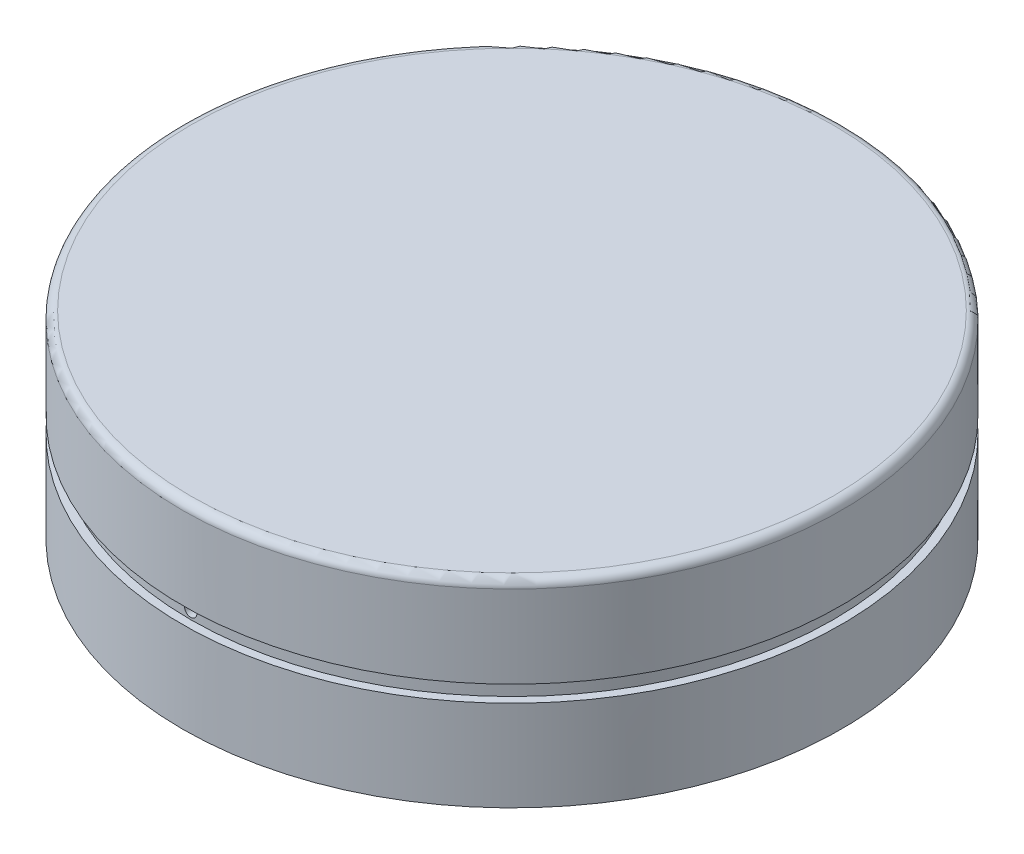
ISO-10303-21;
HEADER;
FILE_DESCRIPTION(('STEP AP214'),'2;1');
FILE_NAME('part.step','',(''),(''),'','','');
FILE_SCHEMA(('AUTOMOTIVE_DESIGN { 1 0 10303 214 1 1 1 1 }'));
ENDSEC;
DATA;
#1=APPLICATION_CONTEXT('core data for automotive mechanical design processes');
#2=APPLICATION_PROTOCOL_DEFINITION('international standard','automotive_design',2000,#1);
#3=PRODUCT_CONTEXT('',#1,'mechanical');
#4=PRODUCT('Part','Part','',(#3));
#5=PRODUCT_RELATED_PRODUCT_CATEGORY('part','',(#4));
#6=PRODUCT_DEFINITION_FORMATION('','',#4);
#7=PRODUCT_DEFINITION_CONTEXT('part definition',#1,'design');
#8=PRODUCT_DEFINITION('design','',#6,#7);
#9=PRODUCT_DEFINITION_SHAPE('','',#8);
#10=(LENGTH_UNIT() NAMED_UNIT(*) SI_UNIT(.MILLI.,.METRE.));
#11=(NAMED_UNIT(*) PLANE_ANGLE_UNIT() SI_UNIT($,.RADIAN.));
#12=(NAMED_UNIT(*) SI_UNIT($,.STERADIAN.) SOLID_ANGLE_UNIT());
#13=UNCERTAINTY_MEASURE_WITH_UNIT(LENGTH_MEASURE(1.E-05),#10,'distance_accuracy_value','');
#14=(GEOMETRIC_REPRESENTATION_CONTEXT(3) GLOBAL_UNCERTAINTY_ASSIGNED_CONTEXT((#13)) GLOBAL_UNIT_ASSIGNED_CONTEXT((#10,
#11,#12)) REPRESENTATION_CONTEXT('',''));
#15=CARTESIAN_POINT('',(0.,0.,0.));
#16=DIRECTION('',(0.,0.,1.));
#17=DIRECTION('',(1.,0.,0.));
#18=AXIS2_PLACEMENT_3D('',#15,#16,#17);
#19=CARTESIAN_POINT('',(0.,6.,0.));
#20=DIRECTION('',(0.,-1.,0.));
#21=DIRECTION('',(0.,0.,-1.));
#22=AXIS2_PLACEMENT_3D('',#19,#20,#21);
#23=CYLINDRICAL_SURFACE('',#22,20.);
#24=CARTESIAN_POINT('',(0.,-0.5,0.));
#25=DIRECTION('',(0.,-1.,0.));
#26=DIRECTION('',(0.,0.,-1.));
#27=AXIS2_PLACEMENT_3D('',#24,#25,#26);
#28=CIRCLE('',#27,20.);
#29=CARTESIAN_POINT('',(0.,-0.5,-20.));
#30=VERTEX_POINT('',#29);
#31=EDGE_CURVE('E162',#30,#30,#28,.T.);
#32=ORIENTED_EDGE('',*,*,#31,.T.);
#33=EDGE_LOOP('',(#32));
#34=FACE_BOUND('',#33,.T.);
#35=CARTESIAN_POINT('',(0.,-6.,0.));
#36=DIRECTION('',(0.,1.,0.));
#37=DIRECTION('',(0.,0.,1.));
#38=AXIS2_PLACEMENT_3D('',#35,#36,#37);
#39=CIRCLE('',#38,20.);
#40=CARTESIAN_POINT('',(0.,-6.,20.));
#41=VERTEX_POINT('',#40);
#42=EDGE_CURVE('E145',#41,#41,#39,.T.);
#43=ORIENTED_EDGE('',*,*,#42,.T.);
#44=EDGE_LOOP('',(#43));
#45=FACE_BOUND('',#44,.T.);
#46=ADVANCED_FACE('F39',(#34,#45),#23,.T.);
#47=CARTESIAN_POINT('',(0.,-6.,0.));
#48=DIRECTION('',(0.,1.,0.));
#49=DIRECTION('',(0.,0.,1.));
#50=AXIS2_PLACEMENT_3D('',#47,#48,#49);
#51=PLANE('',#50);
#52=CARTESIAN_POINT('',(0.,-6.,0.));
#53=DIRECTION('',(0.,-1.,0.));
#54=DIRECTION('',(0.,0.,-1.));
#55=AXIS2_PLACEMENT_3D('',#52,#53,#54);
#56=CIRCLE('',#55,19.);
#57=CARTESIAN_POINT('',(0.,-6.,-19.));
#58=VERTEX_POINT('',#57);
#59=EDGE_CURVE('E153',#58,#58,#56,.T.);
#60=ORIENTED_EDGE('',*,*,#59,.F.);
#61=EDGE_LOOP('',(#60));
#62=FACE_BOUND('',#61,.T.);
#63=ORIENTED_EDGE('',*,*,#42,.F.);
#64=EDGE_LOOP('',(#63));
#65=FACE_BOUND('',#64,.T.);
#66=ADVANCED_FACE('F111',(#62,#65),#51,.F.);
#67=CARTESIAN_POINT('',(0.,5.,0.));
#68=DIRECTION('',(0.,1.,0.));
#69=DIRECTION('',(0.,0.,1.));
#70=AXIS2_PLACEMENT_3D('',#67,#68,#69);
#71=PLANE('',#70);
#72=CARTESIAN_POINT('',(0.,5.,0.));
#73=DIRECTION('',(0.,1.,0.));
#74=DIRECTION('',(0.,0.,1.));
#75=AXIS2_PLACEMENT_3D('',#72,#73,#74);
#76=CIRCLE('',#75,7.9);
#77=CARTESIAN_POINT('',(0.,5.,7.9));
#78=VERTEX_POINT('',#77);
#79=EDGE_CURVE('E46',#78,#78,#76,.F.);
#80=ORIENTED_EDGE('',*,*,#79,.F.);
#81=EDGE_LOOP('',(#80));
#82=FACE_BOUND('',#81,.T.);
#83=CARTESIAN_POINT('',(0.,5.,0.));
#84=DIRECTION('',(0.,1.,0.));
#85=DIRECTION('',(0.,0.,1.));
#86=AXIS2_PLACEMENT_3D('',#83,#84,#85);
#87=CIRCLE('',#86,19.);
#88=CARTESIAN_POINT('',(0.,5.,19.));
#89=VERTEX_POINT('',#88);
#90=EDGE_CURVE('E148',#89,#89,#87,.F.);
#91=ORIENTED_EDGE('',*,*,#90,.T.);
#92=EDGE_LOOP('',(#91));
#93=FACE_BOUND('',#92,.T.);
#94=ADVANCED_FACE('F106',(#82,#93),#71,.F.);
#95=CARTESIAN_POINT('',(0.,59.7401153701776,0.));
#96=DIRECTION('',(0.,-1.,0.));
#97=DIRECTION('',(0.,0.,-1.));
#98=AXIS2_PLACEMENT_3D('',#95,#96,#97);
#99=CYLINDRICAL_SURFACE('',#98,19.);
#100=CARTESIAN_POINT('',(0.,0.375,-19.));
#101=CARTESIAN_POINT('',(0.0210617140066825,0.374999066680883,-18.9999999500342));
#102=CARTESIAN_POINT('',(0.0421386475309483,0.373219662071169,-18.9999646033929));
#103=CARTESIAN_POINT('',(0.0837118939057291,0.366146041087272,-18.9998269966186));
#104=CARTESIAN_POINT('',(0.104207479392599,0.360847608010525,-18.9997246562118));
#105=CARTESIAN_POINT('',(0.144009731300136,0.346886958485237,-18.9994646537768));
#106=CARTESIAN_POINT('',(0.163316966343931,0.338226365549888,-18.9993070184528));
#107=CARTESIAN_POINT('',(0.200198052213595,0.31778951175328,-18.9989542158596));
#108=CARTESIAN_POINT('',(0.21777232918228,0.306014019496927,-18.9987590578525));
#109=CARTESIAN_POINT('',(0.250698992429135,0.279677555343755,-18.9983531300634));
#110=CARTESIAN_POINT('',(0.266050875050938,0.265115953767636,-18.9981423567589));
#111=CARTESIAN_POINT('',(0.294092797867601,0.233621517945313,-18.9977289856158));
#112=CARTESIAN_POINT('',(0.30678273289282,0.216688590055548,-18.9975263881005));
#113=CARTESIAN_POINT('',(0.329140584649192,0.180931246230006,-18.9971522068589));
#114=CARTESIAN_POINT('',(0.338808310986764,0.162106711225145,-18.9969806250868));
#115=CARTESIAN_POINT('',(0.354846027995322,0.12310138475274,-18.9966878429425));
#116=CARTESIAN_POINT('',(0.361216028149724,0.102920597185621,-18.9965666424254));
#117=CARTESIAN_POINT('',(0.370476696064507,0.0617783929131159,-18.9963883065815));
#118=CARTESIAN_POINT('',(0.373367816596021,0.0408170781583803,-18.9963311629178));
#119=CARTESIAN_POINT('',(0.375590047560634,-0.00129344323055079,-18.9962873585584));
#120=CARTESIAN_POINT('',(0.374921167782152,-0.0224426493479687,-18.996300697669));
#121=CARTESIAN_POINT('',(0.370042779908349,-0.0643255282850536,-18.996396346851));
#122=CARTESIAN_POINT('',(0.365833764324944,-0.08505925849591,-18.9964786473284));
#123=CARTESIAN_POINT('',(0.353995343150468,-0.125525774284567,-18.9967029259046));
#124=CARTESIAN_POINT('',(0.346365932250407,-0.14525855830869,-18.9968449040959));
#125=CARTESIAN_POINT('',(0.327902728748842,-0.183164602866868,-18.997172543033));
#126=CARTESIAN_POINT('',(0.317068710245521,-0.201337753341405,-18.9973582068582));
#127=CARTESIAN_POINT('',(0.292504005244711,-0.235607442913076,-18.9977522825847));
#128=CARTESIAN_POINT('',(0.278773316546485,-0.251703980432494,-18.9979606945032));
#129=CARTESIAN_POINT('',(0.248802245780262,-0.281366395829723,-18.9983768135495));
#130=CARTESIAN_POINT('',(0.232561435692743,-0.294931841239763,-18.9985845205509));
#131=CARTESIAN_POINT('',(0.198032656421401,-0.319143665384949,-18.9989757791323));
#132=CARTESIAN_POINT('',(0.179744686945036,-0.329790043702956,-18.9991593307089));
#133=CARTESIAN_POINT('',(0.141640490522363,-0.347861465337089,-18.9994815866674));
#134=CARTESIAN_POINT('',(0.121824257388004,-0.355286495608934,-18.9996202908676));
#135=CARTESIAN_POINT('',(0.0812261597297195,-0.366704174765914,-18.9998372122095));
#136=CARTESIAN_POINT('',(0.0604442963679679,-0.370696827781937,-18.9999154294239));
#137=CARTESIAN_POINT('',(0.0185086253380729,-0.375135885476617,-19.0000025499114));
#138=CARTESIAN_POINT('',(-0.00264511898473876,-0.375582888358114,-19.0000114648767));
#139=CARTESIAN_POINT('',(-0.0447273645867218,-0.372919514978223,-18.9999590067934));
#140=CARTESIAN_POINT('',(-0.0656558659730221,-0.369809140408853,-18.9998976337782));
#141=CARTESIAN_POINT('',(-0.10669186780616,-0.360119800422897,-18.9997115255096));
#142=CARTESIAN_POINT('',(-0.126799432275354,-0.353541106048815,-18.9995867952076));
#143=CARTESIAN_POINT('',(-0.165624733634513,-0.337102150047934,-18.9992880316514));
#144=CARTESIAN_POINT('',(-0.184342469415865,-0.327241885803587,-18.999113998358));
#145=CARTESIAN_POINT('',(-0.219859533275984,-0.304518148566986,-18.9987362137416));
#146=CARTESIAN_POINT('',(-0.236658603547163,-0.291654272690224,-18.9985324584333));
#147=CARTESIAN_POINT('',(-0.267858880817499,-0.263289064931155,-18.9981182111754));
#148=CARTESIAN_POINT('',(-0.282260084618327,-0.247787729531001,-18.9979077192167));
#149=CARTESIAN_POINT('',(-0.308257815595282,-0.214585074097727,-18.9975036959749));
#150=CARTESIAN_POINT('',(-0.319853956633257,-0.19688345168558,-18.9973101670293));
#151=CARTESIAN_POINT('',(-0.339909739638354,-0.15978427194809,-18.9969619258218));
#152=CARTESIAN_POINT('',(-0.348369386545682,-0.140386717294023,-18.9968072134989));
#153=CARTESIAN_POINT('',(-0.361911370801583,-0.100447760604627,-18.9965540650941));
#154=CARTESIAN_POINT('',(-0.366993959538113,-0.0799064438342666,-18.9964556248235));
#155=CARTESIAN_POINT('',(-0.37363837768821,-0.0382618304811047,-18.9963261072601));
#156=CARTESIAN_POINT('',(-0.375200204839617,-0.0171585335372289,-18.9962950300106));
#157=CARTESIAN_POINT('',(-0.374758727577386,0.0250070812224033,-18.9963037439571));
#158=CARTESIAN_POINT('',(-0.372756035326026,0.0460694054528439,-18.9963435229846));
#159=CARTESIAN_POINT('',(-0.365243620040265,0.0875588426058498,-18.9964894394211));
#160=CARTESIAN_POINT('',(-0.359733889992482,0.10798595425803,-18.9965955769629));
#161=CARTESIAN_POINT('',(-0.345363811573159,0.147625530709094,-18.9968622444994));
#162=CARTESIAN_POINT('',(-0.336503402597313,0.166837973530717,-18.9970227754778));
#163=CARTESIAN_POINT('',(-0.315683907575146,0.203502022217985,-18.9973801243342));
#164=CARTESIAN_POINT('',(-0.303724939033625,0.220953694821394,-18.997576940836));
#165=CARTESIAN_POINT('',(-0.277046817047925,0.253603116680629,-18.9979846969037));
#166=CARTESIAN_POINT('',(-0.262327483314126,0.268800718598617,-18.9981956373914));
#167=CARTESIAN_POINT('',(-0.230542007770322,0.296513056883199,-18.9986079079662));
#168=CARTESIAN_POINT('',(-0.213475284526378,0.309027126583968,-18.9988092356555));
#169=CARTESIAN_POINT('',(-0.177474924775014,0.331018132911905,-18.9991796313058));
#170=CARTESIAN_POINT('',(-0.158540264593567,0.340493391971926,-18.9993486814272));
#171=CARTESIAN_POINT('',(-0.119363329495554,0.356119552340302,-18.9996351154625));
#172=CARTESIAN_POINT('',(-0.0991226512243175,0.362274429823452,-18.9997525611415));
#173=CARTESIAN_POINT('',(-0.0656278895780548,0.369448728699089,-18.9998910605117));
#174=CARTESIAN_POINT('',(-0.0525913484276804,0.371527848180718,-18.9999317362859));
#175=CARTESIAN_POINT('',(-0.0263718608518637,0.374303775967973,-18.9999862216727));
#176=CARTESIAN_POINT('',(-0.0131889144448393,0.375000584447494,-19.0000000312888));
#177=CARTESIAN_POINT('',(0.,0.375,-19.));
#178=B_SPLINE_CURVE_WITH_KNOTS('',3,(#100,#101,#102,#103,#104,#105,#106,#107,#108,#109,#110,
#111,#112,#113,#114,#115,#116,#117,#118,#119,#120,#121,#122,#123,#124,#125,#126,#127,#128,#129,
#130,#131,#132,#133,#134,#135,#136,#137,#138,#139,#140,#141,#142,#143,#144,#145,#146,#147,#148,
#149,#150,#151,#152,#153,#154,#155,#156,#157,#158,#159,#160,#161,#162,#163,#164,#165,#166,#167,
#168,#169,#170,#171,#172,#173,#174,#175,#176,#177),.UNSPECIFIED.,.T.,.F.,(4,2,2,2,2,2,2,2,2,2,2,
2,2,2,2,2,2,2,2,2,2,2,2,2,2,2,2,2,2,2,2,2,2,2,2,2,2,2,4),(0.,0.0631370017637434,
0.126349794741431,0.189532101540301,0.252698832553315,0.315879856568509,0.379063376303206,
0.442250875681476,0.505438193347665,0.568617286386398,0.631796205710758,0.694966336890675,
0.75813656612085,0.821311249460107,0.884485980796317,0.947671496436304,1.0108570211056,
1.07404280163114,1.1372285061121,1.20040355001726,1.26357856387408,1.32674864145705,
1.38991876942782,1.45309737549235,1.51627606582525,1.57946344824076,1.64265073113115,
1.7058333098378,1.76901592914052,1.83218769865401,1.89535959449894,1.95853263299947,
2.02170327617761,2.08487804670104,2.14806849350121,2.2112937646073,2.27444315409223,
2.31397975681395,2.35351635456195),.UNSPECIFIED.);
#179=CARTESIAN_POINT('',(0.,0.375,-19.));
#180=VERTEX_POINT('',#179);
#181=EDGE_CURVE('E94',#180,#180,#178,.T.);
#182=ORIENTED_EDGE('',*,*,#181,.T.);
#183=EDGE_LOOP('',(#182));
#184=FACE_BOUND('',#183,.T.);
#185=CARTESIAN_POINT('',(0.375,0.,18.9962989816438));
#186=CARTESIAN_POINT('',(0.374999066680474,0.0210617135560697,18.9962990316487));
#187=CARTESIAN_POINT('',(0.373219662144329,0.0421386466312698,18.9963343853776));
#188=CARTESIAN_POINT('',(0.366146041479198,0.0837118920730575,18.9964720174055));
#189=CARTESIAN_POINT('',(0.360847608646131,0.104207477075649,18.9965743759914));
#190=CARTESIAN_POINT('',(0.346886959833859,0.144009727959523,18.9968344179144));
#191=CARTESIAN_POINT('',(0.338226367379483,0.163316962468035,18.9969920745456));
#192=CARTESIAN_POINT('',(0.317789514715165,0.200198047442565,18.9973449135208));
#193=CARTESIAN_POINT('',(0.306014023108931,0.217772324050717,18.9975400866044));
#194=CARTESIAN_POINT('',(0.279677559609564,0.250698987711717,18.9979460317453));
#195=CARTESIAN_POINT('',(0.265115957892182,0.266050870992316,18.998156807323));
#196=CARTESIAN_POINT('',(0.233621521511601,0.294092795078503,18.9985701691817));
#197=CARTESIAN_POINT('',(0.216688593206628,0.306782730716469,18.9987727551388));
#198=CARTESIAN_POINT('',(0.180931249024308,0.32914058310811,18.9991469045084));
#199=CARTESIAN_POINT('',(0.162106714149203,0.338808309582267,18.9993184659672));
#200=CARTESIAN_POINT('',(0.123101387958945,0.354846026879255,18.9996112076246));
#201=CARTESIAN_POINT('',(0.102920600543529,0.361216027183835,18.9997323879681));
#202=CARTESIAN_POINT('',(0.0617783967071687,0.370476695420539,18.9999106924659));
#203=CARTESIAN_POINT('',(0.0408170822391981,0.373367816134149,18.999967824956));
#204=CARTESIAN_POINT('',(-0.00129343859035903,0.375590047562285,19.0000116208489));
#205=CARTESIAN_POINT('',(-0.0224426444352689,0.374921168063323,18.9999982844453));
#206=CARTESIAN_POINT('',(-0.0643255246209736,0.370042780626135,18.9999026533836));
#207=CARTESIAN_POINT('',(-0.0850592563201718,0.365833764918613,18.9998203683123));
#208=CARTESIAN_POINT('',(-0.125525775021596,0.353995342977691,18.9995961264791));
#209=CARTESIAN_POINT('',(-0.145258560470951,0.346365931438058,18.9994541696246));
#210=CARTESIAN_POINT('',(-0.183164606733756,0.327902726624507,18.9991265699676));
#211=CARTESIAN_POINT('',(-0.201337757561379,0.317068707600029,18.9989409240876));
#212=CARTESIAN_POINT('',(-0.235607447616992,0.292504001493507,18.9985468729747));
#213=CARTESIAN_POINT('',(-0.251703985267021,0.278773312210383,18.9983384677245));
#214=CARTESIAN_POINT('',(-0.28136639998149,0.248802241036468,18.9979223478421));
#215=CARTESIAN_POINT('',(-0.294931844696873,0.2325614312437,18.9977146333337));
#216=CARTESIAN_POINT('',(-0.319143667581985,0.198032652806997,18.9973233488248));
#217=CARTESIAN_POINT('',(-0.329790045333193,0.179744683869553,18.9971397788278));
#218=CARTESIAN_POINT('',(-0.347861466562147,0.14164048757736,18.9968174831952));
#219=CARTESIAN_POINT('',(-0.355286496817925,0.121824253950268,18.9966787577437));
#220=CARTESIAN_POINT('',(-0.366704175791096,0.0812261552233554,18.9964618003794));
#221=CARTESIAN_POINT('',(-0.370696828642274,0.0604442912865233,18.9963835683937));
#222=CARTESIAN_POINT('',(-0.375135885717802,0.018508620013967,18.9962964313398));
#223=CARTESIAN_POINT('',(-0.375582888302291,-0.00264512395976846,18.9962875145741));
#224=CARTESIAN_POINT('',(-0.372919514453045,-0.0447273687917161,18.9963399827938));
#225=CARTESIAN_POINT('',(-0.369809139711291,-0.0656558697570547,18.9964013677458));
#226=CARTESIAN_POINT('',(-0.360119799798342,-0.106691869621582,18.9965875084048));
#227=CARTESIAN_POINT('',(-0.353541105843828,-0.126799432584281,18.9967122591566));
#228=CARTESIAN_POINT('',(-0.337102151188138,-0.165624731116805,18.9970110631514));
#229=CARTESIAN_POINT('',(-0.327241887866967,-0.184342465576981,18.9971851164337));
#230=CARTESIAN_POINT('',(-0.304518151967277,-0.219859528575266,18.9975629318419));
#231=CARTESIAN_POINT('',(-0.291654276269271,-0.236658599155442,18.9977666979543));
#232=CARTESIAN_POINT('',(-0.263289068694611,-0.267858877132843,18.9981809528709));
#233=CARTESIAN_POINT('',(-0.247787733301548,-0.282260081333047,18.9983914416841));
#234=CARTESIAN_POINT('',(-0.214585077686245,-0.308257813118448,18.998795446078));
#235=CARTESIAN_POINT('',(-0.196883455085225,-0.319853954565848,18.9989889593196));
#236=CARTESIAN_POINT('',(-0.159784274865921,-0.33990973829054,18.9993371634264));
#237=CARTESIAN_POINT('',(-0.140386719918906,-0.348369385508028,18.9994918543528));
#238=CARTESIAN_POINT('',(-0.100447763458765,-0.36191136998147,18.9997449636633));
#239=CARTESIAN_POINT('',(-0.0799064472560489,-0.366993958759373,18.9998433862382));
#240=CARTESIAN_POINT('',(-0.0382618350956243,-0.373638377184754,18.9999728798579));
#241=CARTESIAN_POINT('',(-0.0171585387763629,-0.375200204567076,19.0000039508594));
#242=CARTESIAN_POINT('',(0.0250070764238216,-0.374758727954967,18.9999952386204));
#243=CARTESIAN_POINT('',(0.0460694017165483,-0.372756035849031,18.9999554675406));
#244=CARTESIAN_POINT('',(0.0875588410289948,-0.365243620479302,18.9998095776904));
#245=CARTESIAN_POINT('',(0.107985953778677,-0.359733890204041,18.9997034587872));
#246=CARTESIAN_POINT('',(0.147625532346408,-0.345363810941817,18.999436831069));
#247=CARTESIAN_POINT('',(0.166837976187954,-0.336503401352629,18.9992763212704));
#248=CARTESIAN_POINT('',(0.203502026657393,-0.31568390479005,18.9989190080147));
#249=CARTESIAN_POINT('',(0.220953700023673,-0.303724935322551,18.998722205934));
#250=CARTESIAN_POINT('',(0.253603121776325,-0.277046812344371,18.9983144656665));
#251=CARTESIAN_POINT('',(0.268800722996342,-0.262327478753926,18.998103526558));
#252=CARTESIAN_POINT('',(0.296513059939937,-0.230542003780365,18.9976912450632));
#253=CARTESIAN_POINT('',(0.309027128995903,-0.213475280961815,18.9974899050714));
#254=CARTESIAN_POINT('',(0.331018134659297,-0.177474921530169,18.9971194765364));
#255=CARTESIAN_POINT('',(0.340493393575823,-0.15854026116758,18.9969504058295));
#256=CARTESIAN_POINT('',(0.356119553625084,-0.119363325680579,18.9966639313724));
#257=CARTESIAN_POINT('',(0.362274430934952,-0.0991226472024734,18.9965464658561));
#258=CARTESIAN_POINT('',(0.369448729303785,-0.06562788602249,18.9964079418642));
#259=CARTESIAN_POINT('',(0.371527848557989,-0.052591345581052,18.9963672584503));
#260=CARTESIAN_POINT('',(0.374303776042958,-0.0263718594268001,18.9963127626851));
#261=CARTESIAN_POINT('',(0.375000584447732,-0.0131889137324162,18.9962989503305));
#262=CARTESIAN_POINT('',(0.375,0.,18.9962989816438));
#263=B_SPLINE_CURVE_WITH_KNOTS('',3,(#185,#186,#187,#188,#189,#190,#191,#192,#193,#194,#195,
#196,#197,#198,#199,#200,#201,#202,#203,#204,#205,#206,#207,#208,#209,#210,#211,#212,#213,#214,
#215,#216,#217,#218,#219,#220,#221,#222,#223,#224,#225,#226,#227,#228,#229,#230,#231,#232,#233,
#234,#235,#236,#237,#238,#239,#240,#241,#242,#243,#244,#245,#246,#247,#248,#249,#250,#251,#252,
#253,#254,#255,#256,#257,#258,#259,#260,#261,#262),.UNSPECIFIED.,.T.,.F.,(4,2,2,2,2,2,2,2,2,2,2,
2,2,2,2,2,2,2,2,2,2,2,2,2,2,2,2,2,2,2,2,2,2,2,2,2,2,2,4),(0.,0.0631370004105573,
0.126349792064433,0.189532097319741,0.252698826812969,0.315879852598064,0.379063374054835,
0.442250872770997,0.505438189807018,0.568617282027475,0.63179620056744,0.694966335981087,
0.758136569394094,0.821311253933605,0.884485986477538,0.947671500364333,1.01085702331033,
1.07404280559783,1.13722851178742,1.20040355459807,1.26357856736108,1.3267486406778,
1.38991876442941,1.45309737121973,1.51627606224396,1.57946344534298,1.64265072891709,
1.70583330580014,1.76901592333304,1.83218769592926,1.89535959482243,1.95853263633186,
2.02170328249675,2.08487805120283,2.14806849622749,2.21129376812744,2.27444315836127,
2.31397975894907,2.35351635455994),.UNSPECIFIED.);
#264=CARTESIAN_POINT('',(0.375,0.,18.9962989816438));
#265=VERTEX_POINT('',#264);
#266=EDGE_CURVE('E65',#265,#265,#263,.T.);
#267=ORIENTED_EDGE('',*,*,#266,.T.);
#268=EDGE_LOOP('',(#267));
#269=FACE_BOUND('',#268,.T.);
#270=ORIENTED_EDGE('',*,*,#59,.T.);
#271=EDGE_LOOP('',(#270));
#272=FACE_BOUND('',#271,.T.);
#273=ORIENTED_EDGE('',*,*,#90,.F.);
#274=EDGE_LOOP('',(#273));
#275=FACE_BOUND('',#274,.T.);
#276=ADVANCED_FACE('F101',(#184,#269,#272,#275),#99,.F.);
#277=CARTESIAN_POINT('',(20.,0.5,0.));
#278=DIRECTION('',(0.,1.,0.));
#279=DIRECTION('',(0.,0.,1.));
#280=AXIS2_PLACEMENT_3D('',#277,#278,#279);
#281=PLANE('',#280);
#282=CARTESIAN_POINT('',(0.,0.5,0.));
#283=DIRECTION('',(0.,-1.,0.));
#284=DIRECTION('',(0.,0.,-1.));
#285=AXIS2_PLACEMENT_3D('',#282,#283,#284);
#286=CIRCLE('',#285,19.5);
#287=CARTESIAN_POINT('',(0.,0.5,-19.5));
#288=VERTEX_POINT('',#287);
#289=EDGE_CURVE('E157',#288,#288,#286,.T.);
#290=ORIENTED_EDGE('',*,*,#289,.F.);
#291=EDGE_LOOP('',(#290));
#292=FACE_BOUND('',#291,.T.);
#293=CARTESIAN_POINT('',(0.,0.5,0.));
#294=DIRECTION('',(0.,-1.,0.));
#295=DIRECTION('',(0.,0.,-1.));
#296=AXIS2_PLACEMENT_3D('',#293,#294,#295);
#297=CIRCLE('',#296,20.);
#298=CARTESIAN_POINT('',(0.,0.5,-20.));
#299=VERTEX_POINT('',#298);
#300=EDGE_CURVE('E140',#299,#299,#297,.T.);
#301=ORIENTED_EDGE('',*,*,#300,.T.);
#302=EDGE_LOOP('',(#301));
#303=FACE_BOUND('',#302,.T.);
#304=ADVANCED_FACE('F105',(#292,#303),#281,.F.);
#305=CARTESIAN_POINT('',(0.,0.,0.));
#306=DIRECTION('',(0.,-1.,0.));
#307=DIRECTION('',(0.,0.,-1.));
#308=AXIS2_PLACEMENT_3D('',#305,#306,#307);
#309=CYLINDRICAL_SURFACE('',#308,19.5);
#310=CARTESIAN_POINT('',(0.,0.375,-19.5));
#311=CARTESIAN_POINT('',(-0.021061825395819,0.374999066642657,-19.4999999513113));
#312=CARTESIAN_POINT('',(-0.0421388730331005,0.373219643285047,-19.499965510626));
#313=CARTESIAN_POINT('',(-0.0837123521300542,0.366145943493455,-19.4998314307967));
#314=CARTESIAN_POINT('',(-0.104208056104654,0.360847449602914,-19.4997317134234));
#315=CARTESIAN_POINT('',(-0.144010545586865,0.346886629039047,-19.4994783750619));
#316=CARTESIAN_POINT('',(-0.163317899421838,0.338225925051414,-19.4993247800798));
#317=CARTESIAN_POINT('',(-0.200199199315589,0.317788799567073,-19.4989810205405));
#318=CARTESIAN_POINT('',(-0.217773571694504,0.306013146997928,-19.4987908650115));
#319=CARTESIAN_POINT('',(-0.250700281389642,0.279676403008967,-19.4983953443704));
#320=CARTESIAN_POINT('',(-0.266052128742825,0.265114699032464,-19.4981899759197));
#321=CARTESIAN_POINT('',(-0.294093955445191,0.23362006451438,-19.4977872058996));
#322=CARTESIAN_POINT('',(-0.306783829656055,0.216687040358253,-19.4975898046451));
#323=CARTESIAN_POINT('',(-0.329141486073175,0.180929600158558,-19.4972252223924));
#324=CARTESIAN_POINT('',(-0.338809090383789,0.162105072864235,-19.4970580431732));
#325=CARTESIAN_POINT('',(-0.354846572651396,0.123099802864114,-19.496772774299));
#326=CARTESIAN_POINT('',(-0.361216459947267,0.102919063999183,-19.4966546845049));
#327=CARTESIAN_POINT('',(-0.370476955840227,0.0617768536796089,-19.4964809260771));
#328=CARTESIAN_POINT('',(-0.37336799395679,0.040815478936458,-19.4964252497376));
#329=CARTESIAN_POINT('',(-0.375590044355128,-0.0012951443228866,-19.4963825724435));
#330=CARTESIAN_POINT('',(-0.374921066254549,-0.0224443923313727,-19.4963955713033));
#331=CARTESIAN_POINT('',(-0.370042449560664,-0.064327493160299,-19.4964887713577));
#332=CARTESIAN_POINT('',(-0.365833278470488,-0.0850614004587844,-19.4965689636789));
#333=CARTESIAN_POINT('',(-0.353994479773345,-0.125528244257335,-19.4967874960962));
#334=CARTESIAN_POINT('',(-0.346364846943183,-0.145261179228821,-19.496925836281));
#335=CARTESIAN_POINT('',(-0.327901168216112,-0.183167413928424,-19.4972450786229));
#336=CARTESIAN_POINT('',(-0.317066907894941,-0.201340609188064,-19.4974259836279));
#337=CARTESIAN_POINT('',(-0.292501686486711,-0.235610336277876,-19.49780995782));
#338=CARTESIAN_POINT('',(-0.278770723369615,-0.25170686665269,-19.4980130270228));
#339=CARTESIAN_POINT('',(-0.248799220227464,-0.281369070362333,-19.4984184758012));
#340=CARTESIAN_POINT('',(-0.232558273839053,-0.294934333101506,-19.4986208552598));
#341=CARTESIAN_POINT('',(-0.19802926606159,-0.319145767929551,-19.4990020770511));
#342=CARTESIAN_POINT('',(-0.179741204381371,-0.329791939603234,-19.4991809193804));
#343=CARTESIAN_POINT('',(-0.141636882658716,-0.347862932120164,-19.4994949058982));
#344=CARTESIAN_POINT('',(-0.121820616753064,-0.355287740603383,-19.4996300499189));
#345=CARTESIAN_POINT('',(-0.0812225083893956,-0.366704980504237,-19.4998414014916));
#346=CARTESIAN_POINT('',(-0.0604406670368468,-0.370697415851429,-19.499917609111));
#347=CARTESIAN_POINT('',(-0.0185049043508078,-0.375136075465216,-19.5000024882021));
#348=CARTESIAN_POINT('',(0.00264895684985659,-0.375582867659985,-19.5000111704898));
#349=CARTESIAN_POINT('',(0.0447314013509217,-0.372919037251931,-19.4999600487516));
#350=CARTESIAN_POINT('',(0.0656599847525269,-0.369808416247318,-19.4999002447565));
#351=CARTESIAN_POINT('',(0.106696197531524,-0.360118529707407,-19.4997188988505));
#352=CARTESIAN_POINT('',(0.126803887687175,-0.353539521472287,-19.4995973615193));
#353=CARTESIAN_POINT('',(0.165629383881649,-0.337099879141056,-19.499306248477));
#354=CARTESIAN_POINT('',(0.184347188877,-0.327239242581254,-19.4991366727298));
#355=CARTESIAN_POINT('',(0.219864193045963,-0.30451479082981,-19.4987685679219));
#356=CARTESIAN_POINT('',(0.236663147454087,-0.29165059314442,-19.4985700351748));
#357=CARTESIAN_POINT('',(0.267863129046359,-0.263284751126062,-19.4981664082332));
#358=CARTESIAN_POINT('',(0.282264153145037,-0.247783103399481,-19.4979613140303));
#359=CARTESIAN_POINT('',(0.308261364559004,-0.21457997141051,-19.4975676554949));
#360=CARTESIAN_POINT('',(0.31985718524714,-0.196878200059268,-19.497379093325));
#361=CARTESIAN_POINT('',(0.339912309485187,-0.159778797377559,-19.4970397921301));
#362=CARTESIAN_POINT('',(0.348371617893012,-0.140381168673738,-19.4968890530466));
#363=CARTESIAN_POINT('',(0.361912951117444,-0.100442067389361,-19.4966424083507));
#364=CARTESIAN_POINT('',(0.366995214694831,-0.0799006757854144,-19.4965464988618));
#365=CARTESIAN_POINT('',(0.373638976391492,-0.0382559786776646,-19.4964203156251));
#366=CARTESIAN_POINT('',(0.37520047204176,-0.0171526727798191,-19.4963900419233));
#367=CARTESIAN_POINT('',(0.374758336090877,0.0250130872623809,-19.4963985450207));
#368=CARTESIAN_POINT('',(0.372755285992895,0.0460755475089649,-19.4964373105572));
#369=CARTESIAN_POINT('',(0.365242106222943,0.0875651988321964,-19.496579498221));
#370=CARTESIAN_POINT('',(0.359731969535362,0.107992388637957,-19.4966829204776));
#371=CARTESIAN_POINT('',(0.34536103370071,0.147632056178622,-19.4969427618922));
#372=CARTESIAN_POINT('',(0.336500173821115,0.166844511888862,-19.4970991820108));
#373=CARTESIAN_POINT('',(0.315679743378792,0.203508502952742,-19.4974473771735));
#374=CARTESIAN_POINT('',(0.303720290532852,0.220960105166926,-19.4976391508744));
#375=CARTESIAN_POINT('',(0.277041302082348,0.253609144308001,-19.4980364551782));
#376=CARTESIAN_POINT('',(0.262321609928767,0.268806453293379,-19.498241986561));
#377=CARTESIAN_POINT('',(0.230535471133193,0.296518141641623,-19.4986436826484));
#378=CARTESIAN_POINT('',(0.213468443022508,0.309031854267498,-19.4988398450158));
#379=CARTESIAN_POINT('',(0.177467616902725,0.331022047683601,-19.4992007339276));
#380=CARTESIAN_POINT('',(0.158532802204798,0.34049686225393,-19.4993654432064));
#381=CARTESIAN_POINT('',(0.119355657985686,0.356122119316529,-19.4996445186836));
#382=CARTESIAN_POINT('',(0.0991149251792875,0.362276538462999,-19.4997589450725));
#383=CARTESIAN_POINT('',(0.0656213847210497,0.369449837185048,-19.4998938749231));
#384=CARTESIAN_POINT('',(0.052586116459531,0.371528541972475,-19.4999334998809));
#385=CARTESIAN_POINT('',(0.026369221403096,0.374303915502392,-19.4999865776607));
#386=CARTESIAN_POINT('',(0.0131875946256508,0.375000584409853,-19.5000000304858));
#387=CARTESIAN_POINT('',(0.,0.375,-19.5));
#388=B_SPLINE_CURVE_WITH_KNOTS('',3,(#310,#311,#312,#313,#314,#315,#316,#317,#318,#319,#320,
#321,#322,#323,#324,#325,#326,#327,#328,#329,#330,#331,#332,#333,#334,#335,#336,#337,#338,#339,
#340,#341,#342,#343,#344,#345,#346,#347,#348,#349,#350,#351,#352,#353,#354,#355,#356,#357,#358,
#359,#360,#361,#362,#363,#364,#365,#366,#367,#368,#369,#370,#371,#372,#373,#374,#375,#376,#377,
#378,#379,#380,#381,#382,#383,#384,#385,#386,#387),.UNSPECIFIED.,.T.,.F.,(4,2,2,2,2,2,2,2,2,2,2,
2,2,2,2,2,2,2,2,2,2,2,2,2,2,2,2,2,2,2,2,2,2,2,2,2,2,2,4),(0.,0.0631373407868699,
0.126350485863721,0.189533160566138,0.252700253105594,0.315881249904849,0.379064741655498,
0.442251951787605,0.505438982977474,0.568618211918796,0.631797270176874,0.694967986581584,
0.758138799451061,0.821313840088112,0.884488924998963,0.947674248617443,1.01085958122292,
1.07404515626165,1.13723065896221,1.20040604063535,1.26358139392621,1.32675206125161,
1.38992277600266,1.45310153973088,1.51628038475197,1.57946748250125,1.64265448238424,
1.70583701440143,1.76901959072656,1.83219186068928,1.89536425702282,1.95853779842348,
2.02170894018777,2.08488366583438,2.14807406904477,2.21129906039318,2.27444816161729,
2.31398081084315,2.35351345535003),.UNSPECIFIED.);
#389=CARTESIAN_POINT('',(0.,0.375,-19.5));
#390=VERTEX_POINT('',#389);
#391=EDGE_CURVE('E57',#390,#390,#388,.T.);
#392=ORIENTED_EDGE('',*,*,#391,.T.);
#393=EDGE_LOOP('',(#392));
#394=FACE_BOUND('',#393,.T.);
#395=CARTESIAN_POINT('',(0.375,0.,19.4963938973339));
#396=CARTESIAN_POINT('',(0.374999066642288,-0.0210618249896715,19.496393946059));
#397=CARTESIAN_POINT('',(0.373219643350989,-0.0421388722221989,19.4964283933018));
#398=CARTESIAN_POINT('',(0.366145943846708,-0.0837123504782293,19.4965624964917));
#399=CARTESIAN_POINT('',(0.3608474501758,-0.104208054016343,19.4966622306804));
#400=CARTESIAN_POINT('',(0.346886630254591,-0.14401054257591,19.4969156055692));
#401=CARTESIAN_POINT('',(0.338225926700473,-0.163317895928423,19.4970692202617));
#402=CARTESIAN_POINT('',(0.317788802236692,-0.200199195015378,19.4974130134561));
#403=CARTESIAN_POINT('',(0.306013150253514,-0.217773567069342,19.4976031829312));
#404=CARTESIAN_POINT('',(0.279676406853839,-0.250700277137765,19.4979987196228));
#405=CARTESIAN_POINT('',(0.265114702750009,-0.266052125084734,19.4982040901759));
#406=CARTESIAN_POINT('',(0.233620067728745,-0.294093952931348,19.4986068516064));
#407=CARTESIAN_POINT('',(0.216687043198376,-0.306783827694493,19.4988042421683));
#408=CARTESIAN_POINT('',(0.180929602677118,-0.329141484684182,19.4991687949379));
#409=CARTESIAN_POINT('',(0.162105075499764,-0.338809089117894,19.4993359553669));
#410=CARTESIAN_POINT('',(0.123099805753979,-0.354846571645458,19.49962118679));
#411=CARTESIAN_POINT('',(0.102919067025798,-0.361216459076687,19.4997392579231));
#412=CARTESIAN_POINT('',(0.0617768570993286,-0.370476955259811,19.4999129873552));
#413=CARTESIAN_POINT('',(0.0408154826146261,-0.373367993540507,19.4999686533593));
#414=CARTESIAN_POINT('',(-0.00129514014058439,-0.375590044356637,19.5000113228219));
#415=CARTESIAN_POINT('',(-0.0224443879034756,-0.374921066507995,19.4999983264659));
#416=CARTESIAN_POINT('',(-0.0643274898578418,-0.370042450207629,19.4999051431736));
#417=CARTESIAN_POINT('',(-0.0850613984978113,-0.365833279005572,19.4998249651042));
#418=CARTESIAN_POINT('',(-0.125528244921713,-0.353994479617586,19.4996064666762));
#419=CARTESIAN_POINT('',(-0.145261181177793,-0.346364846210947,19.4994681462288));
#420=CARTESIAN_POINT('',(-0.183167417413774,-0.32790116630134,19.4991489402229));
#421=CARTESIAN_POINT('',(-0.201340612991621,-0.31706690551045,19.498968051818));
#422=CARTESIAN_POINT('',(-0.235610340517547,-0.292501683105655,19.4985841003935));
#423=CARTESIAN_POINT('',(-0.251706871010046,-0.278770719461406,19.4983810373585));
#424=CARTESIAN_POINT('',(-0.281369074104291,-0.248799215951824,19.4979755878048));
#425=CARTESIAN_POINT('',(-0.294934336217375,-0.232558269829074,19.4977732014012));
#426=CARTESIAN_POINT('',(-0.319145769909727,-0.198029262803871,19.4973919556245));
#427=CARTESIAN_POINT('',(-0.329791941072562,-0.17974120160938,19.4972130962549));
#428=CARTESIAN_POINT('',(-0.347862933224314,-0.141636880004296,19.4968990730373));
#429=CARTESIAN_POINT('',(-0.355287741693052,-0.121820613654518,19.4967639093591));
#430=CARTESIAN_POINT('',(-0.36670498142823,-0.0812225043276446,19.4965525244657));
#431=CARTESIAN_POINT('',(-0.370697416626837,-0.0604406624567516,19.4964763031828));
#432=CARTESIAN_POINT('',(-0.375136075682553,-0.0185048995520387,19.4963914087682));
#433=CARTESIAN_POINT('',(-0.375582867609621,0.00264896133394246,19.4963827248158));
#434=CARTESIAN_POINT('',(-0.372919036778547,0.044731405140851,19.4964338559315));
#435=CARTESIAN_POINT('',(-0.369808415618579,0.0656599881629806,19.4964936709688));
#436=CARTESIAN_POINT('',(-0.360118529144523,0.106696199167593,19.4966750468379));
#437=CARTESIAN_POINT('',(-0.353539521287593,0.126803887965423,19.4967966030867));
#438=CARTESIAN_POINT('',(-0.337099880168854,0.16562938161224,19.4970877535369));
#439=CARTESIAN_POINT('',(-0.32723924444115,0.184347185416819,19.4972573477744));
#440=CARTESIAN_POINT('',(-0.304514793894681,0.219864188809087,19.4976254810651));
#441=CARTESIAN_POINT('',(-0.291650596370371,0.23666314349577,19.4978240238054));
#442=CARTESIAN_POINT('',(-0.263284754518129,0.267863125725427,19.498227657829));
#443=CARTESIAN_POINT('',(-0.247783106797882,0.28226415018411,19.4984327491206));
#444=CARTESIAN_POINT('',(-0.214579974644813,0.308261362326729,19.4988263902188));
#445=CARTESIAN_POINT('',(-0.196878203123377,0.319857183383845,19.4990149378612));
#446=CARTESIAN_POINT('',(-0.159778800007496,0.339912308270405,19.4993542047359));
#447=CARTESIAN_POINT('',(-0.140381171039693,0.348371616957755,19.4995049240267));
#448=CARTESIAN_POINT('',(-0.100442069961995,0.361912950378266,19.4997515325603));
#449=CARTESIAN_POINT('',(-0.0799006788696578,0.366995213992962,19.4998474256811));
#450=CARTESIAN_POINT('',(-0.0382559828368955,0.373638975937777,19.4999735867711));
#451=CARTESIAN_POINT('',(-0.0171526775019964,0.375200471796187,19.5000038546942));
#452=CARTESIAN_POINT('',(0.0250130829373922,0.374758336431268,19.499995353178));
#453=CARTESIAN_POINT('',(0.0460755441415113,0.372755286464333,19.4999565949946));
#454=CARTESIAN_POINT('',(0.0875651974112304,0.365242106618619,19.4998144319258));
#455=CARTESIAN_POINT('',(0.107992388206256,0.359731969725953,19.4997110269111));
#456=CARTESIAN_POINT('',(0.14763205765469,0.345361033131494,19.4994512223308));
#457=CARTESIAN_POINT('',(0.166844514284124,0.336500172699076,19.4992948218047));
#458=CARTESIAN_POINT('',(0.203508506954135,0.315679740868367,19.4989466595733));
#459=CARTESIAN_POINT('',(0.220960109855818,0.303720287187851,19.4987548992115));
#460=CARTESIAN_POINT('',(0.253609148900714,0.277041297842881,19.4983576095205));
#461=CARTESIAN_POINT('',(0.268806457256977,0.262321605818548,19.4981520794117));
#462=CARTESIAN_POINT('',(0.296518144396542,0.230535467537033,19.4977503732192));
#463=CARTESIAN_POINT('',(0.309031856441241,0.21346843980981,19.4975541994695));
#464=CARTESIAN_POINT('',(0.331022049258432,0.177467613978173,19.4971932801371));
#465=CARTESIAN_POINT('',(0.340496863699467,0.158532799116906,19.497028551817));
#466=CARTESIAN_POINT('',(0.356122120474494,0.119355654547045,19.4967494389488));
#467=CARTESIAN_POINT('',(0.362276539464794,0.0991149215541155,19.4966349942094));
#468=CARTESIAN_POINT('',(0.369449837730057,0.0656213815161126,19.4965000415852));
#469=CARTESIAN_POINT('',(0.371528542312508,0.0525861138936174,19.496460409562));
#470=CARTESIAN_POINT('',(0.374303915569975,0.0263692201185606,19.4964073221836));
#471=CARTESIAN_POINT('',(0.375000584410067,0.0131875939834807,19.4963938668254));
#472=CARTESIAN_POINT('',(0.375,0.,19.4963938973339));
#473=B_SPLINE_CURVE_WITH_KNOTS('',3,(#395,#396,#397,#398,#399,#400,#401,#402,#403,#404,#405,
#406,#407,#408,#409,#410,#411,#412,#413,#414,#415,#416,#417,#418,#419,#420,#421,#422,#423,#424,
#425,#426,#427,#428,#429,#430,#431,#432,#433,#434,#435,#436,#437,#438,#439,#440,#441,#442,#443,
#444,#445,#446,#447,#448,#449,#450,#451,#452,#453,#454,#455,#456,#457,#458,#459,#460,#461,#462,
#463,#464,#465,#466,#467,#468,#469,#470,#471,#472),.UNSPECIFIED.,.T.,.F.,(4,2,2,2,2,2,2,2,2,2,2,
2,2,2,2,2,2,2,2,2,2,2,2,2,2,2,2,2,2,2,2,2,2,2,2,2,2,2,4),(0.,0.0631373395672161,
0.126350483450888,0.189533156762062,0.252700247931705,0.315881246326202,0.379064739628987,
0.442251949164283,0.505438979786129,0.568618207989985,0.631797265541132,0.694967985761817,
0.758138802401393,0.821313844120155,0.884488930119453,0.947674252157822,1.01085958321013,
1.07404515983696,1.13723066407758,1.20040604476406,1.2635813970689,1.32675206054909,
1.38992277149737,1.4531015358799,1.51628038152425,1.5794674798894,1.64265448038846,
1.70583701076209,1.76901958549215,1.83219185823361,1.89536425731479,1.9585378014272,
2.02170894588329,2.08488366989184,2.14807407150187,2.21129906356602,2.27444816546534,
2.31398081276772,2.35351345534821),.UNSPECIFIED.);
#474=CARTESIAN_POINT('',(0.375,0.,19.4963938973339));
#475=VERTEX_POINT('',#474);
#476=EDGE_CURVE('E66',#475,#475,#473,.T.);
#477=ORIENTED_EDGE('',*,*,#476,.T.);
#478=EDGE_LOOP('',(#477));
#479=FACE_BOUND('',#478,.T.);
#480=CARTESIAN_POINT('',(0.,-0.5,0.));
#481=DIRECTION('',(0.,-1.,0.));
#482=DIRECTION('',(0.,0.,-1.));
#483=AXIS2_PLACEMENT_3D('',#480,#481,#482);
#484=CIRCLE('',#483,19.5);
#485=CARTESIAN_POINT('',(0.,-0.5,-19.5));
#486=VERTEX_POINT('',#485);
#487=EDGE_CURVE('E160',#486,#486,#484,.T.);
#488=ORIENTED_EDGE('',*,*,#487,.F.);
#489=EDGE_LOOP('',(#488));
#490=FACE_BOUND('',#489,.T.);
#491=ORIENTED_EDGE('',*,*,#289,.T.);
#492=EDGE_LOOP('',(#491));
#493=FACE_BOUND('',#492,.T.);
#494=ADVANCED_FACE('F70',(#394,#479,#490,#493),#309,.T.);
#495=CARTESIAN_POINT('',(19.5,-0.5,0.));
#496=DIRECTION('',(0.,-1.,0.));
#497=DIRECTION('',(0.,0.,-1.));
#498=AXIS2_PLACEMENT_3D('',#495,#496,#497);
#499=PLANE('',#498);
#500=ORIENTED_EDGE('',*,*,#31,.F.);
#501=EDGE_LOOP('',(#500));
#502=FACE_BOUND('',#501,.T.);
#503=ORIENTED_EDGE('',*,*,#487,.T.);
#504=EDGE_LOOP('',(#503));
#505=FACE_BOUND('',#504,.T.);
#506=ADVANCED_FACE('F82',(#502,#505),#499,.F.);
#507=CARTESIAN_POINT('',(0.,6.,0.));
#508=DIRECTION('',(0.,1.,0.));
#509=DIRECTION('',(0.,0.,1.));
#510=AXIS2_PLACEMENT_3D('',#507,#508,#509);
#511=PLANE('',#510);
#512=CARTESIAN_POINT('',(0.,6.,0.));
#513=DIRECTION('',(0.,1.,0.));
#514=DIRECTION('',(0.,0.,1.));
#515=AXIS2_PLACEMENT_3D('',#512,#513,#514);
#516=CIRCLE('',#515,19.5);
#517=CARTESIAN_POINT('',(0.,6.,19.5));
#518=VERTEX_POINT('',#517);
#519=EDGE_CURVE('E54',#518,#518,#516,.T.);
#520=ORIENTED_EDGE('',*,*,#519,.T.);
#521=EDGE_LOOP('',(#520));
#522=FACE_BOUND('',#521,.T.);
#523=ADVANCED_FACE('F114',(#522),#511,.T.);
#524=CARTESIAN_POINT('',(0.,5.5,0.));
#525=DIRECTION('',(0.,1.,0.));
#526=DIRECTION('',(0.,0.,1.));
#527=AXIS2_PLACEMENT_3D('',#524,#525,#526);
#528=TOROIDAL_SURFACE('',#527,19.5,0.5);
#529=CARTESIAN_POINT('',(0.,5.5,0.));
#530=DIRECTION('',(0.,1.,0.));
#531=DIRECTION('',(0.,0.,1.));
#532=AXIS2_PLACEMENT_3D('',#529,#530,#531);
#533=CIRCLE('',#532,20.);
#534=CARTESIAN_POINT('',(0.,5.5,20.));
#535=VERTEX_POINT('',#534);
#536=EDGE_CURVE('E50',#535,#535,#533,.F.);
#537=ORIENTED_EDGE('',*,*,#536,.F.);
#538=EDGE_LOOP('',(#537));
#539=FACE_BOUND('',#538,.T.);
#540=ORIENTED_EDGE('',*,*,#519,.F.);
#541=EDGE_LOOP('',(#540));
#542=FACE_BOUND('',#541,.T.);
#543=ADVANCED_FACE('F41',(#539,#542),#528,.T.);
#544=ORIENTED_EDGE('',*,*,#300,.F.);
#545=EDGE_LOOP('',(#544));
#546=FACE_BOUND('',#545,.T.);
#547=ORIENTED_EDGE('',*,*,#536,.T.);
#548=EDGE_LOOP('',(#547));
#549=FACE_BOUND('',#548,.T.);
#550=ADVANCED_FACE('F122',(#546,#549),#23,.T.);
#551=CARTESIAN_POINT('',(0.,0.,-20.));
#552=DIRECTION('',(0.,0.,1.));
#553=DIRECTION('',(1.,0.,0.));
#554=AXIS2_PLACEMENT_3D('',#551,#552,#553);
#555=CYLINDRICAL_SURFACE('',#554,0.375);
#556=ORIENTED_EDGE('',*,*,#476,.F.);
#557=EDGE_LOOP('',(#556));
#558=FACE_BOUND('',#557,.T.);
#559=ORIENTED_EDGE('',*,*,#266,.F.);
#560=EDGE_LOOP('',(#559));
#561=FACE_BOUND('',#560,.T.);
#562=ADVANCED_FACE('F79',(#558,#561),#555,.F.);
#563=ORIENTED_EDGE('',*,*,#391,.F.);
#564=EDGE_LOOP('',(#563));
#565=FACE_BOUND('',#564,.T.);
#566=ORIENTED_EDGE('',*,*,#181,.F.);
#567=EDGE_LOOP('',(#566));
#568=FACE_BOUND('',#567,.T.);
#569=ADVANCED_FACE('F74',(#565,#568),#555,.F.);
#570=CARTESIAN_POINT('',(0.,5.,0.));
#571=DIRECTION('',(0.,1.,0.));
#572=DIRECTION('',(0.,0.,1.));
#573=AXIS2_PLACEMENT_3D('',#570,#571,#572);
#574=CYLINDRICAL_SURFACE('',#573,5.9);
#575=CARTESIAN_POINT('',(0.,1.,0.));
#576=DIRECTION('',(0.,1.,0.));
#577=DIRECTION('',(0.,0.,1.));
#578=AXIS2_PLACEMENT_3D('',#575,#576,#577);
#579=CIRCLE('',#578,5.9);
#580=CARTESIAN_POINT('',(0.,1.,5.9));
#581=VERTEX_POINT('',#580);
#582=EDGE_CURVE('E95',#581,#581,#579,.T.);
#583=ORIENTED_EDGE('',*,*,#582,.F.);
#584=EDGE_LOOP('',(#583));
#585=FACE_BOUND('',#584,.T.);
#586=CARTESIAN_POINT('',(0.,5.,0.));
#587=DIRECTION('',(0.,1.,0.));
#588=DIRECTION('',(0.,0.,1.));
#589=AXIS2_PLACEMENT_3D('',#586,#587,#588);
#590=CIRCLE('',#589,5.9);
#591=CARTESIAN_POINT('',(0.,5.,5.9));
#592=VERTEX_POINT('',#591);
#593=EDGE_CURVE('E11',#592,#592,#590,.T.);
#594=ORIENTED_EDGE('',*,*,#593,.T.);
#595=EDGE_LOOP('',(#594));
#596=FACE_BOUND('',#595,.T.);
#597=ADVANCED_FACE('F78',(#585,#596),#574,.F.);
#598=CARTESIAN_POINT('',(5.9,1.,0.));
#599=DIRECTION('',(0.,1.,0.));
#600=DIRECTION('',(0.,0.,1.));
#601=AXIS2_PLACEMENT_3D('',#598,#599,#600);
#602=PLANE('',#601);
#603=CARTESIAN_POINT('',(0.,1.,0.));
#604=DIRECTION('',(0.,1.,0.));
#605=DIRECTION('',(0.,0.,1.));
#606=AXIS2_PLACEMENT_3D('',#603,#604,#605);
#607=CIRCLE('',#606,6.9);
#608=CARTESIAN_POINT('',(0.,1.,6.9));
#609=VERTEX_POINT('',#608);
#610=EDGE_CURVE('E252',#609,#609,#607,.T.);
#611=ORIENTED_EDGE('',*,*,#610,.F.);
#612=EDGE_LOOP('',(#611));
#613=FACE_BOUND('',#612,.T.);
#614=ORIENTED_EDGE('',*,*,#582,.T.);
#615=EDGE_LOOP('',(#614));
#616=FACE_BOUND('',#615,.T.);
#617=ADVANCED_FACE('F229',(#613,#616),#602,.F.);
#618=CARTESIAN_POINT('',(0.,1.,0.));
#619=DIRECTION('',(0.,1.,0.));
#620=DIRECTION('',(0.,0.,1.));
#621=AXIS2_PLACEMENT_3D('',#618,#619,#620);
#622=CONICAL_SURFACE('',#621,6.9,0.244978663126864);
#623=ORIENTED_EDGE('',*,*,#79,.T.);
#624=EDGE_LOOP('',(#623));
#625=FACE_BOUND('',#624,.T.);
#626=ORIENTED_EDGE('',*,*,#610,.T.);
#627=EDGE_LOOP('',(#626));
#628=FACE_BOUND('',#627,.T.);
#629=ADVANCED_FACE('F221',(#625,#628),#622,.T.);
#630=ORIENTED_EDGE('',*,*,#593,.F.);
#631=EDGE_LOOP('',(#630));
#632=FACE_BOUND('',#631,.T.);
#633=ADVANCED_FACE('F113',(#632),#71,.F.);
#634=CLOSED_SHELL('',(#46,#66,#94,#276,#304,#494,#506,#523,#543,#550,#562,#569,#597,#617,#629,#633));
#635=MANIFOLD_SOLID_BREP('B2',#634);
#636=ADVANCED_BREP_SHAPE_REPRESENTATION('',(#18,#635),#14);
#637=SHAPE_DEFINITION_REPRESENTATION(#9,#636);
ENDSEC;
END-ISO-10303-21;
